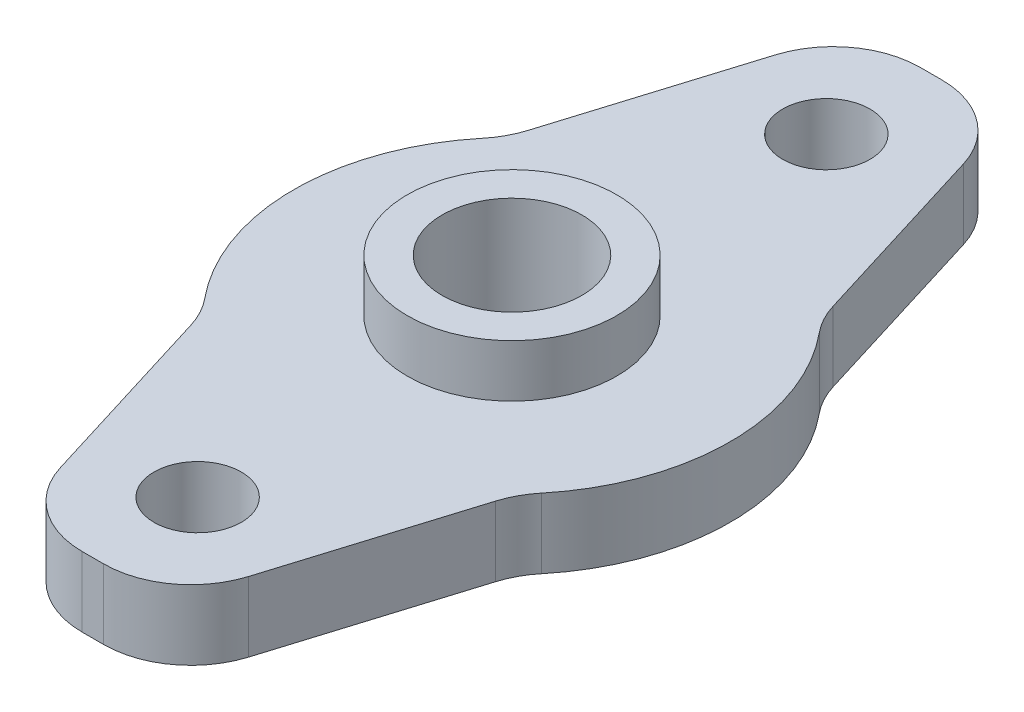
ISO-10303-21;
HEADER;
FILE_DESCRIPTION(('STEP AP214'),'2;1');
FILE_NAME('part.step','',(''),(''),'','','');
FILE_SCHEMA(('AUTOMOTIVE_DESIGN { 1 0 10303 214 1 1 1 1 }'));
ENDSEC;
DATA;
#1=APPLICATION_CONTEXT('core data for automotive mechanical design processes');
#2=APPLICATION_PROTOCOL_DEFINITION('international standard','automotive_design',2000,#1);
#3=PRODUCT_CONTEXT('',#1,'mechanical');
#4=PRODUCT('Part','Part','',(#3));
#5=PRODUCT_RELATED_PRODUCT_CATEGORY('part','',(#4));
#6=PRODUCT_DEFINITION_FORMATION('','',#4);
#7=PRODUCT_DEFINITION_CONTEXT('part definition',#1,'design');
#8=PRODUCT_DEFINITION('design','',#6,#7);
#9=PRODUCT_DEFINITION_SHAPE('','',#8);
#10=(LENGTH_UNIT() NAMED_UNIT(*) SI_UNIT(.MILLI.,.METRE.));
#11=(NAMED_UNIT(*) PLANE_ANGLE_UNIT() SI_UNIT($,.RADIAN.));
#12=(NAMED_UNIT(*) SI_UNIT($,.STERADIAN.) SOLID_ANGLE_UNIT());
#13=UNCERTAINTY_MEASURE_WITH_UNIT(LENGTH_MEASURE(1.E-05),#10,'distance_accuracy_value','');
#14=(GEOMETRIC_REPRESENTATION_CONTEXT(3) GLOBAL_UNCERTAINTY_ASSIGNED_CONTEXT((#13)) GLOBAL_UNIT_ASSIGNED_CONTEXT((#10,
#11,#12)) REPRESENTATION_CONTEXT('',''));
#15=CARTESIAN_POINT('',(0.,0.,0.));
#16=DIRECTION('',(0.,0.,1.));
#17=DIRECTION('',(1.,0.,0.));
#18=AXIS2_PLACEMENT_3D('',#15,#16,#17);
#19=CARTESIAN_POINT('',(0.,4.,0.));
#20=DIRECTION('',(0.,1.,0.));
#21=DIRECTION('',(0.,0.,1.));
#22=AXIS2_PLACEMENT_3D('',#19,#20,#21);
#23=PLANE('',#22);
#24=CARTESIAN_POINT('',(0.,4.,-18.));
#25=DIRECTION('',(0.,1.,0.));
#26=DIRECTION('',(0.,0.,1.));
#27=AXIS2_PLACEMENT_3D('',#24,#25,#26);
#28=CIRCLE('',#27,2.5);
#29=CARTESIAN_POINT('',(0.,4.,-15.5));
#30=VERTEX_POINT('',#29);
#31=EDGE_CURVE('E205',#30,#30,#28,.T.);
#32=ORIENTED_EDGE('',*,*,#31,.F.);
#33=EDGE_LOOP('',(#32));
#34=FACE_BOUND('',#33,.T.);
#35=CARTESIAN_POINT('',(0.,4.,18.));
#36=DIRECTION('',(0.,1.,0.));
#37=DIRECTION('',(0.,0.,1.));
#38=AXIS2_PLACEMENT_3D('',#35,#36,#37);
#39=CIRCLE('',#38,2.5);
#40=CARTESIAN_POINT('',(0.,4.,20.5));
#41=VERTEX_POINT('',#40);
#42=EDGE_CURVE('E208',#41,#41,#39,.F.);
#43=ORIENTED_EDGE('',*,*,#42,.T.);
#44=EDGE_LOOP('',(#43));
#45=FACE_BOUND('',#44,.T.);
#46=DIRECTION('',(-0.294499880692092,0.,-0.955651516125174));
#47=VECTOR('',#46,1.);
#48=CARTESIAN_POINT('',(-10.6870562396262,4.,3.29339380978635));
#49=LINE('',#48,#47);
#50=CARTESIAN_POINT('',(-5.39302963854122,4.,20.4724994034605));
#51=VERTEX_POINT('',#50);
#52=CARTESIAN_POINT('',(-8.72558245149579,4.,9.65837227789803));
#53=VERTEX_POINT('',#52);
#54=EDGE_CURVE('E214',#51,#53,#49,.T.);
#55=ORIENTED_EDGE('',*,*,#54,.F.);
#56=CARTESIAN_POINT('',(-0.614772057915349,4.,19.));
#57=DIRECTION('',(0.,1.,0.));
#58=DIRECTION('',(0.,0.,1.));
#59=AXIS2_PLACEMENT_3D('',#56,#57,#58);
#60=CIRCLE('',#59,5.);
#61=CARTESIAN_POINT('',(-0.614772057915349,4.,24.));
#62=VERTEX_POINT('',#61);
#63=EDGE_CURVE('E331',#51,#62,#60,.T.);
#64=ORIENTED_EDGE('',*,*,#63,.T.);
#65=DIRECTION('',(1.,0.,0.));
#66=VECTOR('',#65,1.);
#67=CARTESIAN_POINT('',(0.,4.,24.));
#68=LINE('',#67,#66);
#69=CARTESIAN_POINT('',(0.614772057915356,4.,24.));
#70=VERTEX_POINT('',#69);
#71=EDGE_CURVE('E211',#62,#70,#68,.T.);
#72=ORIENTED_EDGE('',*,*,#71,.T.);
#73=CARTESIAN_POINT('',(0.614772057915356,4.,19.));
#74=DIRECTION('',(0.,1.,0.));
#75=DIRECTION('',(0.,0.,1.));
#76=AXIS2_PLACEMENT_3D('',#73,#74,#75);
#77=CIRCLE('',#76,5.);
#78=CARTESIAN_POINT('',(5.39302963854122,4.,20.4724994034605));
#79=VERTEX_POINT('',#78);
#80=EDGE_CURVE('E329',#70,#79,#77,.T.);
#81=ORIENTED_EDGE('',*,*,#80,.T.);
#82=DIRECTION('',(0.294499880692093,0.,-0.955651516125174));
#83=VECTOR('',#82,1.);
#84=CARTESIAN_POINT('',(10.6870562396262,4.,3.29339380978637));
#85=LINE('',#84,#83);
#86=CARTESIAN_POINT('',(8.72558245149582,4.,9.65837227789799));
#87=VERTEX_POINT('',#86);
#88=EDGE_CURVE('E228',#79,#87,#85,.T.);
#89=ORIENTED_EDGE('',*,*,#88,.T.);
#90=CARTESIAN_POINT('',(13.5038400321217,4.,11.1308716813585));
#91=DIRECTION('',(0.,1.,0.));
#92=DIRECTION('',(0.,0.,1.));
#93=AXIS2_PLACEMENT_3D('',#90,#91,#92);
#94=CIRCLE('',#93,5.);
#95=CARTESIAN_POINT('',(9.64560002294407,4.,7.95062262954175));
#96=VERTEX_POINT('',#95);
#97=EDGE_CURVE('E349',#87,#96,#94,.F.);
#98=ORIENTED_EDGE('',*,*,#97,.T.);
#99=CARTESIAN_POINT('',(0.,4.,0.));
#100=DIRECTION('',(0.,1.,0.));
#101=DIRECTION('',(0.,0.,1.));
#102=AXIS2_PLACEMENT_3D('',#99,#100,#101);
#103=CIRCLE('',#102,12.5);
#104=CARTESIAN_POINT('',(9.64560002294407,4.,-7.95062262954175));
#105=VERTEX_POINT('',#104);
#106=EDGE_CURVE('E225',#96,#105,#103,.T.);
#107=ORIENTED_EDGE('',*,*,#106,.T.);
#108=CARTESIAN_POINT('',(13.5038400321217,4.,-11.1308716813585));
#109=DIRECTION('',(0.,1.,0.));
#110=DIRECTION('',(0.,0.,1.));
#111=AXIS2_PLACEMENT_3D('',#108,#109,#110);
#112=CIRCLE('',#111,5.);
#113=CARTESIAN_POINT('',(8.72558245149582,4.,-9.65837227789799));
#114=VERTEX_POINT('',#113);
#115=EDGE_CURVE('E345',#105,#114,#112,.F.);
#116=ORIENTED_EDGE('',*,*,#115,.T.);
#117=DIRECTION('',(0.294499880692093,0.,0.955651516125174));
#118=VECTOR('',#117,1.);
#119=CARTESIAN_POINT('',(10.6870562396262,4.,-3.29339380978637));
#120=LINE('',#119,#118);
#121=CARTESIAN_POINT('',(5.39302963854122,4.,-20.4724994034605));
#122=VERTEX_POINT('',#121);
#123=EDGE_CURVE('E222',#122,#114,#120,.T.);
#124=ORIENTED_EDGE('',*,*,#123,.F.);
#125=CARTESIAN_POINT('',(0.614772057915356,4.,-19.));
#126=DIRECTION('',(0.,1.,0.));
#127=DIRECTION('',(0.,0.,1.));
#128=AXIS2_PLACEMENT_3D('',#125,#126,#127);
#129=CIRCLE('',#128,5.);
#130=CARTESIAN_POINT('',(0.614772057915356,4.,-24.));
#131=VERTEX_POINT('',#130);
#132=EDGE_CURVE('E51',#122,#131,#129,.T.);
#133=ORIENTED_EDGE('',*,*,#132,.T.);
#134=DIRECTION('',(1.,0.,0.));
#135=VECTOR('',#134,1.);
#136=CARTESIAN_POINT('',(0.,4.,-24.));
#137=LINE('',#136,#135);
#138=CARTESIAN_POINT('',(-0.614772057915353,4.,-24.));
#139=VERTEX_POINT('',#138);
#140=EDGE_CURVE('E220',#139,#131,#137,.T.);
#141=ORIENTED_EDGE('',*,*,#140,.F.);
#142=CARTESIAN_POINT('',(-0.614772057915353,4.,-19.));
#143=DIRECTION('',(0.,1.,0.));
#144=DIRECTION('',(0.,0.,1.));
#145=AXIS2_PLACEMENT_3D('',#142,#143,#144);
#146=CIRCLE('',#145,5.);
#147=CARTESIAN_POINT('',(-5.39302963854122,4.,-20.4724994034605));
#148=VERTEX_POINT('',#147);
#149=EDGE_CURVE('E326',#139,#148,#146,.T.);
#150=ORIENTED_EDGE('',*,*,#149,.T.);
#151=DIRECTION('',(-0.294499880692092,0.,0.955651516125174));
#152=VECTOR('',#151,1.);
#153=CARTESIAN_POINT('',(-10.6870562396262,4.,-3.29339380978636));
#154=LINE('',#153,#152);
#155=CARTESIAN_POINT('',(-8.7255824514958,4.,-9.65837227789802));
#156=VERTEX_POINT('',#155);
#157=EDGE_CURVE('E217',#148,#156,#154,.T.);
#158=ORIENTED_EDGE('',*,*,#157,.T.);
#159=CARTESIAN_POINT('',(-13.5038400321217,4.,-11.1308716813585));
#160=DIRECTION('',(0.,1.,0.));
#161=DIRECTION('',(0.,0.,1.));
#162=AXIS2_PLACEMENT_3D('',#159,#160,#161);
#163=CIRCLE('',#162,5.);
#164=CARTESIAN_POINT('',(-9.64560002294405,4.,-7.95062262954177));
#165=VERTEX_POINT('',#164);
#166=EDGE_CURVE('E160',#156,#165,#163,.F.);
#167=ORIENTED_EDGE('',*,*,#166,.T.);
#168=CARTESIAN_POINT('',(-9.64560002294405,4.,7.95062262954178));
#169=VERTEX_POINT('',#168);
#170=EDGE_CURVE('E169',#165,#169,#103,.T.);
#171=ORIENTED_EDGE('',*,*,#170,.T.);
#172=CARTESIAN_POINT('',(-13.5038400321217,4.,11.1308716813585));
#173=DIRECTION('',(0.,1.,0.));
#174=DIRECTION('',(0.,0.,1.));
#175=AXIS2_PLACEMENT_3D('',#172,#173,#174);
#176=CIRCLE('',#175,5.);
#177=EDGE_CURVE('E11',#169,#53,#176,.F.);
#178=ORIENTED_EDGE('',*,*,#177,.T.);
#179=EDGE_LOOP('',(#55,#64,#72,#81,#89,#98,#107,#116,#124,#133,#141,#150,#158,#167,#171,#178));
#180=FACE_BOUND('',#179,.T.);
#181=CARTESIAN_POINT('',(0.,4.,0.));
#182=DIRECTION('',(0.,1.,0.));
#183=DIRECTION('',(0.,0.,1.));
#184=AXIS2_PLACEMENT_3D('',#181,#182,#183);
#185=CIRCLE('',#184,6.);
#186=CARTESIAN_POINT('',(0.,4.,6.));
#187=VERTEX_POINT('',#186);
#188=EDGE_CURVE('E202',#187,#187,#185,.T.);
#189=ORIENTED_EDGE('',*,*,#188,.F.);
#190=EDGE_LOOP('',(#189));
#191=FACE_BOUND('',#190,.T.);
#192=ADVANCED_FACE('F36',(#34,#45,#180,#191),#23,.T.);
#193=CARTESIAN_POINT('',(10.6870562396262,4.,3.29339380978637));
#194=DIRECTION('',(-0.955651516125174,0.,-0.294499880692093));
#195=DIRECTION('',(-0.294499880692093,0.,0.955651516125174));
#196=AXIS2_PLACEMENT_3D('',#193,#194,#195);
#197=PLANE('',#196);
#198=DIRECTION('',(0.294499880692093,0.,-0.955651516125174));
#199=VECTOR('',#198,1.);
#200=CARTESIAN_POINT('',(10.6870562396262,0.,3.29339380978637));
#201=LINE('',#200,#199);
#202=CARTESIAN_POINT('',(5.39302963854122,0.,20.4724994034605));
#203=VERTEX_POINT('',#202);
#204=CARTESIAN_POINT('',(8.72558245149582,0.,9.65837227789799));
#205=VERTEX_POINT('',#204);
#206=EDGE_CURVE('E189',#203,#205,#201,.T.);
#207=ORIENTED_EDGE('',*,*,#206,.T.);
#208=DIRECTION('',(0.,1.,0.));
#209=VECTOR('',#208,1.);
#210=CARTESIAN_POINT('',(8.72558245149582,4.,9.65837227789799));
#211=LINE('',#210,#209);
#212=EDGE_CURVE('E369',#205,#87,#211,.T.);
#213=ORIENTED_EDGE('',*,*,#212,.T.);
#214=ORIENTED_EDGE('',*,*,#88,.F.);
#215=DIRECTION('',(0.,-1.,0.));
#216=VECTOR('',#215,1.);
#217=CARTESIAN_POINT('',(5.39302963854122,4.,20.4724994034605));
#218=LINE('',#217,#216);
#219=EDGE_CURVE('E361',#79,#203,#218,.T.);
#220=ORIENTED_EDGE('',*,*,#219,.T.);
#221=EDGE_LOOP('',(#207,#213,#214,#220));
#222=FACE_BOUND('',#221,.T.);
#223=ADVANCED_FACE('F254',(#222),#197,.F.);
#224=CARTESIAN_POINT('',(0.,4.,0.));
#225=DIRECTION('',(0.,-1.,0.));
#226=DIRECTION('',(0.,0.,-1.));
#227=AXIS2_PLACEMENT_3D('',#224,#225,#226);
#228=CYLINDRICAL_SURFACE('',#227,12.5);
#229=CARTESIAN_POINT('',(0.,0.,0.));
#230=DIRECTION('',(0.,1.,0.));
#231=DIRECTION('',(0.,0.,1.));
#232=AXIS2_PLACEMENT_3D('',#229,#230,#231);
#233=CIRCLE('',#232,12.5);
#234=CARTESIAN_POINT('',(9.64560002294407,0.,7.95062262954175));
#235=VERTEX_POINT('',#234);
#236=CARTESIAN_POINT('',(9.64560002294407,0.,-7.95062262954175));
#237=VERTEX_POINT('',#236);
#238=EDGE_CURVE('E180',#235,#237,#233,.T.);
#239=ORIENTED_EDGE('',*,*,#238,.T.);
#240=DIRECTION('',(0.,-1.,0.));
#241=VECTOR('',#240,1.);
#242=CARTESIAN_POINT('',(9.64560002294407,4.,-7.95062262954175));
#243=LINE('',#242,#241);
#244=EDGE_CURVE('E358',#237,#105,#243,.F.);
#245=ORIENTED_EDGE('',*,*,#244,.T.);
#246=ORIENTED_EDGE('',*,*,#106,.F.);
#247=DIRECTION('',(0.,-1.,0.));
#248=VECTOR('',#247,1.);
#249=CARTESIAN_POINT('',(9.64560002294407,4.,7.95062262954175));
#250=LINE('',#249,#248);
#251=EDGE_CURVE('E357',#96,#235,#250,.T.);
#252=ORIENTED_EDGE('',*,*,#251,.T.);
#253=EDGE_LOOP('',(#239,#245,#246,#252));
#254=FACE_BOUND('',#253,.T.);
#255=ADVANCED_FACE('F260',(#254),#228,.T.);
#256=CARTESIAN_POINT('',(10.6870562396262,4.,-3.29339380978637));
#257=DIRECTION('',(0.955651516125174,0.,-0.294499880692093));
#258=DIRECTION('',(-0.294499880692093,0.,-0.955651516125174));
#259=AXIS2_PLACEMENT_3D('',#256,#257,#258);
#260=PLANE('',#259);
#261=ORIENTED_EDGE('',*,*,#123,.T.);
#262=DIRECTION('',(0.,-1.,0.));
#263=VECTOR('',#262,1.);
#264=CARTESIAN_POINT('',(8.72558245149582,4.,-9.65837227789799));
#265=LINE('',#264,#263);
#266=CARTESIAN_POINT('',(8.72558245149582,0.,-9.65837227789799));
#267=VERTEX_POINT('',#266);
#268=EDGE_CURVE('E359',#114,#267,#265,.T.);
#269=ORIENTED_EDGE('',*,*,#268,.T.);
#270=DIRECTION('',(0.294499880692093,0.,0.955651516125174));
#271=VECTOR('',#270,1.);
#272=CARTESIAN_POINT('',(10.6870562396262,0.,-3.29339380978637));
#273=LINE('',#272,#271);
#274=CARTESIAN_POINT('',(5.39302963854122,0.,-20.4724994034605));
#275=VERTEX_POINT('',#274);
#276=EDGE_CURVE('E188',#275,#267,#273,.T.);
#277=ORIENTED_EDGE('',*,*,#276,.F.);
#278=DIRECTION('',(0.,-1.,0.));
#279=VECTOR('',#278,1.);
#280=CARTESIAN_POINT('',(5.39302963854122,4.,-20.4724994034605));
#281=LINE('',#280,#279);
#282=EDGE_CURVE('E364',#275,#122,#281,.F.);
#283=ORIENTED_EDGE('',*,*,#282,.T.);
#284=EDGE_LOOP('',(#261,#269,#277,#283));
#285=FACE_BOUND('',#284,.T.);
#286=ADVANCED_FACE('F295',(#285),#260,.T.);
#287=CARTESIAN_POINT('',(0.,4.,-24.));
#288=DIRECTION('',(0.,0.,-1.));
#289=DIRECTION('',(-1.,0.,0.));
#290=AXIS2_PLACEMENT_3D('',#287,#288,#289);
#291=PLANE('',#290);
#292=DIRECTION('',(1.,0.,0.));
#293=VECTOR('',#292,1.);
#294=CARTESIAN_POINT('',(0.,0.,-24.));
#295=LINE('',#294,#293);
#296=CARTESIAN_POINT('',(-0.614772057915353,0.,-24.));
#297=VERTEX_POINT('',#296);
#298=CARTESIAN_POINT('',(0.614772057915356,0.,-24.));
#299=VERTEX_POINT('',#298);
#300=EDGE_CURVE('E183',#297,#299,#295,.T.);
#301=ORIENTED_EDGE('',*,*,#300,.F.);
#302=DIRECTION('',(0.,-1.,0.));
#303=VECTOR('',#302,1.);
#304=CARTESIAN_POINT('',(-0.614772057915353,4.,-24.));
#305=LINE('',#304,#303);
#306=EDGE_CURVE('E58',#297,#139,#305,.F.);
#307=ORIENTED_EDGE('',*,*,#306,.T.);
#308=ORIENTED_EDGE('',*,*,#140,.T.);
#309=DIRECTION('',(0.,-1.,0.));
#310=VECTOR('',#309,1.);
#311=CARTESIAN_POINT('',(0.614772057915356,4.,-24.));
#312=LINE('',#311,#310);
#313=EDGE_CURVE('E338',#131,#299,#312,.T.);
#314=ORIENTED_EDGE('',*,*,#313,.T.);
#315=EDGE_LOOP('',(#301,#307,#308,#314));
#316=FACE_BOUND('',#315,.T.);
#317=ADVANCED_FACE('F291',(#316),#291,.T.);
#318=CARTESIAN_POINT('',(-10.6870562396262,4.,-3.29339380978636));
#319=DIRECTION('',(0.955651516125174,0.,0.294499880692092));
#320=DIRECTION('',(0.294499880692092,0.,-0.955651516125174));
#321=AXIS2_PLACEMENT_3D('',#318,#319,#320);
#322=PLANE('',#321);
#323=DIRECTION('',(-0.294499880692092,0.,0.955651516125174));
#324=VECTOR('',#323,1.);
#325=CARTESIAN_POINT('',(-10.6870562396262,0.,-3.29339380978636));
#326=LINE('',#325,#324);
#327=CARTESIAN_POINT('',(-5.39302963854122,0.,-20.4724994034605));
#328=VERTEX_POINT('',#327);
#329=CARTESIAN_POINT('',(-8.7255824514958,0.,-9.65837227789802));
#330=VERTEX_POINT('',#329);
#331=EDGE_CURVE('E178',#328,#330,#326,.T.);
#332=ORIENTED_EDGE('',*,*,#331,.T.);
#333=DIRECTION('',(0.,1.,0.));
#334=VECTOR('',#333,1.);
#335=CARTESIAN_POINT('',(-8.7255824514958,4.,-9.65837227789802));
#336=LINE('',#335,#334);
#337=EDGE_CURVE('E155',#330,#156,#336,.T.);
#338=ORIENTED_EDGE('',*,*,#337,.T.);
#339=ORIENTED_EDGE('',*,*,#157,.F.);
#340=DIRECTION('',(0.,-1.,0.));
#341=VECTOR('',#340,1.);
#342=CARTESIAN_POINT('',(-5.39302963854122,0.,-20.4724994034605));
#343=LINE('',#342,#341);
#344=EDGE_CURVE('E170',#148,#328,#343,.T.);
#345=ORIENTED_EDGE('',*,*,#344,.T.);
#346=EDGE_LOOP('',(#332,#338,#339,#345));
#347=FACE_BOUND('',#346,.T.);
#348=ADVANCED_FACE('F288',(#347),#322,.F.);
#349=ORIENTED_EDGE('',*,*,#170,.F.);
#350=DIRECTION('',(0.,-1.,0.));
#351=VECTOR('',#350,1.);
#352=CARTESIAN_POINT('',(-9.64560002294405,4.,-7.95062262954177));
#353=LINE('',#352,#351);
#354=CARTESIAN_POINT('',(-9.64560002294405,0.,-7.95062262954177));
#355=VERTEX_POINT('',#354);
#356=EDGE_CURVE('E154',#165,#355,#353,.T.);
#357=ORIENTED_EDGE('',*,*,#356,.T.);
#358=CARTESIAN_POINT('',(-9.64560002294405,0.,7.95062262954178));
#359=VERTEX_POINT('',#358);
#360=EDGE_CURVE('E166',#355,#359,#233,.T.);
#361=ORIENTED_EDGE('',*,*,#360,.T.);
#362=DIRECTION('',(0.,-1.,0.));
#363=VECTOR('',#362,1.);
#364=CARTESIAN_POINT('',(-9.64560002294405,4.,7.95062262954178));
#365=LINE('',#364,#363);
#366=EDGE_CURVE('E171',#359,#169,#365,.F.);
#367=ORIENTED_EDGE('',*,*,#366,.T.);
#368=EDGE_LOOP('',(#349,#357,#361,#367));
#369=FACE_BOUND('',#368,.T.);
#370=ADVANCED_FACE('F165',(#369),#228,.T.);
#371=CARTESIAN_POINT('',(-10.6870562396262,4.,3.29339380978635));
#372=DIRECTION('',(-0.955651516125174,0.,0.294499880692092));
#373=DIRECTION('',(0.294499880692092,0.,0.955651516125174));
#374=AXIS2_PLACEMENT_3D('',#371,#372,#373);
#375=PLANE('',#374);
#376=ORIENTED_EDGE('',*,*,#54,.T.);
#377=DIRECTION('',(0.,-1.,0.));
#378=VECTOR('',#377,1.);
#379=CARTESIAN_POINT('',(-8.72558245149579,4.,9.65837227789803));
#380=LINE('',#379,#378);
#381=CARTESIAN_POINT('',(-8.72558245149579,0.,9.65837227789803));
#382=VERTEX_POINT('',#381);
#383=EDGE_CURVE('E373',#53,#382,#380,.T.);
#384=ORIENTED_EDGE('',*,*,#383,.T.);
#385=DIRECTION('',(-0.294499880692092,0.,-0.955651516125174));
#386=VECTOR('',#385,1.);
#387=CARTESIAN_POINT('',(-10.6870562396262,0.,3.29339380978635));
#388=LINE('',#387,#386);
#389=CARTESIAN_POINT('',(-5.39302963854122,0.,20.4724994034605));
#390=VERTEX_POINT('',#389);
#391=EDGE_CURVE('E177',#390,#382,#388,.T.);
#392=ORIENTED_EDGE('',*,*,#391,.F.);
#393=DIRECTION('',(0.,-1.,0.));
#394=VECTOR('',#393,1.);
#395=CARTESIAN_POINT('',(-5.39302963854122,4.,20.4724994034605));
#396=LINE('',#395,#394);
#397=EDGE_CURVE('E371',#390,#51,#396,.F.);
#398=ORIENTED_EDGE('',*,*,#397,.T.);
#399=EDGE_LOOP('',(#376,#384,#392,#398));
#400=FACE_BOUND('',#399,.T.);
#401=ADVANCED_FACE('F275',(#400),#375,.T.);
#402=CARTESIAN_POINT('',(0.,4.,0.));
#403=DIRECTION('',(0.,-1.,0.));
#404=DIRECTION('',(0.,0.,-1.));
#405=AXIS2_PLACEMENT_3D('',#402,#403,#404);
#406=CYLINDRICAL_SURFACE('',#405,4.);
#407=CARTESIAN_POINT('',(0.,0.,0.));
#408=DIRECTION('',(0.,1.,0.));
#409=DIRECTION('',(0.,0.,1.));
#410=AXIS2_PLACEMENT_3D('',#407,#408,#409);
#411=CIRCLE('',#410,4.);
#412=CARTESIAN_POINT('',(0.,0.,4.));
#413=VERTEX_POINT('',#412);
#414=EDGE_CURVE('E407',#413,#413,#411,.T.);
#415=ORIENTED_EDGE('',*,*,#414,.F.);
#416=EDGE_LOOP('',(#415));
#417=FACE_BOUND('',#416,.T.);
#418=CARTESIAN_POINT('',(0.,7.,0.));
#419=DIRECTION('',(0.,1.,0.));
#420=DIRECTION('',(0.,0.,1.));
#421=AXIS2_PLACEMENT_3D('',#418,#419,#420);
#422=CIRCLE('',#421,4.);
#423=CARTESIAN_POINT('',(0.,7.,4.));
#424=VERTEX_POINT('',#423);
#425=EDGE_CURVE('E233',#424,#424,#422,.T.);
#426=ORIENTED_EDGE('',*,*,#425,.T.);
#427=EDGE_LOOP('',(#426));
#428=FACE_BOUND('',#427,.T.);
#429=ADVANCED_FACE('F238',(#417,#428),#406,.F.);
#430=CARTESIAN_POINT('',(0.,4.,18.));
#431=DIRECTION('',(0.,-1.,0.));
#432=DIRECTION('',(0.,0.,-1.));
#433=AXIS2_PLACEMENT_3D('',#430,#431,#432);
#434=CYLINDRICAL_SURFACE('',#433,2.5);
#435=ORIENTED_EDGE('',*,*,#42,.F.);
#436=EDGE_LOOP('',(#435));
#437=FACE_BOUND('',#436,.T.);
#438=CARTESIAN_POINT('',(0.,0.,18.));
#439=DIRECTION('',(0.,1.,0.));
#440=DIRECTION('',(0.,0.,1.));
#441=AXIS2_PLACEMENT_3D('',#438,#439,#440);
#442=CIRCLE('',#441,2.5);
#443=CARTESIAN_POINT('',(0.,0.,20.5));
#444=VERTEX_POINT('',#443);
#445=EDGE_CURVE('E404',#444,#444,#442,.F.);
#446=ORIENTED_EDGE('',*,*,#445,.T.);
#447=EDGE_LOOP('',(#446));
#448=FACE_BOUND('',#447,.T.);
#449=ADVANCED_FACE('F274',(#437,#448),#434,.F.);
#450=CARTESIAN_POINT('',(0.,4.,24.));
#451=DIRECTION('',(0.,0.,-1.));
#452=DIRECTION('',(-1.,0.,0.));
#453=AXIS2_PLACEMENT_3D('',#450,#451,#452);
#454=PLANE('',#453);
#455=ORIENTED_EDGE('',*,*,#71,.F.);
#456=DIRECTION('',(0.,-1.,0.));
#457=VECTOR('',#456,1.);
#458=CARTESIAN_POINT('',(-0.614772057915349,0.,24.));
#459=LINE('',#458,#457);
#460=CARTESIAN_POINT('',(-0.614772057915349,0.,24.));
#461=VERTEX_POINT('',#460);
#462=EDGE_CURVE('E378',#62,#461,#459,.T.);
#463=ORIENTED_EDGE('',*,*,#462,.T.);
#464=DIRECTION('',(1.,0.,0.));
#465=VECTOR('',#464,1.);
#466=CARTESIAN_POINT('',(0.,0.,24.));
#467=LINE('',#466,#465);
#468=CARTESIAN_POINT('',(0.614772057915356,0.,24.));
#469=VERTEX_POINT('',#468);
#470=EDGE_CURVE('E181',#461,#469,#467,.T.);
#471=ORIENTED_EDGE('',*,*,#470,.T.);
#472=DIRECTION('',(0.,-1.,0.));
#473=VECTOR('',#472,1.);
#474=CARTESIAN_POINT('',(0.614772057915356,4.,24.));
#475=LINE('',#474,#473);
#476=EDGE_CURVE('E376',#469,#70,#475,.F.);
#477=ORIENTED_EDGE('',*,*,#476,.T.);
#478=EDGE_LOOP('',(#455,#463,#471,#477));
#479=FACE_BOUND('',#478,.T.);
#480=ADVANCED_FACE('F270',(#479),#454,.F.);
#481=CARTESIAN_POINT('',(0.,4.,-18.));
#482=DIRECTION('',(0.,-1.,0.));
#483=DIRECTION('',(0.,0.,-1.));
#484=AXIS2_PLACEMENT_3D('',#481,#482,#483);
#485=CYLINDRICAL_SURFACE('',#484,2.5);
#486=ORIENTED_EDGE('',*,*,#31,.T.);
#487=EDGE_LOOP('',(#486));
#488=FACE_BOUND('',#487,.T.);
#489=CARTESIAN_POINT('',(0.,0.,-18.));
#490=DIRECTION('',(0.,1.,0.));
#491=DIRECTION('',(0.,0.,1.));
#492=AXIS2_PLACEMENT_3D('',#489,#490,#491);
#493=CIRCLE('',#492,2.5);
#494=CARTESIAN_POINT('',(0.,0.,-15.5));
#495=VERTEX_POINT('',#494);
#496=EDGE_CURVE('E231',#495,#495,#493,.T.);
#497=ORIENTED_EDGE('',*,*,#496,.F.);
#498=EDGE_LOOP('',(#497));
#499=FACE_BOUND('',#498,.T.);
#500=ADVANCED_FACE('F267',(#488,#499),#485,.F.);
#501=CARTESIAN_POINT('',(0.,0.,0.));
#502=DIRECTION('',(0.,1.,0.));
#503=DIRECTION('',(0.,0.,1.));
#504=AXIS2_PLACEMENT_3D('',#501,#502,#503);
#505=PLANE('',#504);
#506=ORIENTED_EDGE('',*,*,#470,.F.);
#507=CARTESIAN_POINT('',(-0.614772057915349,0.,19.));
#508=DIRECTION('',(0.,1.,0.));
#509=DIRECTION('',(0.,0.,1.));
#510=AXIS2_PLACEMENT_3D('',#507,#508,#509);
#511=CIRCLE('',#510,5.);
#512=EDGE_CURVE('E333',#461,#390,#511,.F.);
#513=ORIENTED_EDGE('',*,*,#512,.T.);
#514=ORIENTED_EDGE('',*,*,#391,.T.);
#515=CARTESIAN_POINT('',(-13.5038400321217,0.,11.1308716813585));
#516=DIRECTION('',(0.,1.,0.));
#517=DIRECTION('',(0.,0.,1.));
#518=AXIS2_PLACEMENT_3D('',#515,#516,#517);
#519=CIRCLE('',#518,5.);
#520=EDGE_CURVE('E44',#382,#359,#519,.T.);
#521=ORIENTED_EDGE('',*,*,#520,.T.);
#522=ORIENTED_EDGE('',*,*,#360,.F.);
#523=CARTESIAN_POINT('',(-13.5038400321217,0.,-11.1308716813585));
#524=DIRECTION('',(0.,1.,0.));
#525=DIRECTION('',(0.,0.,1.));
#526=AXIS2_PLACEMENT_3D('',#523,#524,#525);
#527=CIRCLE('',#526,5.);
#528=EDGE_CURVE('E150',#355,#330,#527,.T.);
#529=ORIENTED_EDGE('',*,*,#528,.T.);
#530=ORIENTED_EDGE('',*,*,#331,.F.);
#531=CARTESIAN_POINT('',(-0.614772057915353,0.,-19.));
#532=DIRECTION('',(0.,1.,0.));
#533=DIRECTION('',(0.,0.,1.));
#534=AXIS2_PLACEMENT_3D('',#531,#532,#533);
#535=CIRCLE('',#534,5.);
#536=EDGE_CURVE('E383',#328,#297,#535,.F.);
#537=ORIENTED_EDGE('',*,*,#536,.T.);
#538=ORIENTED_EDGE('',*,*,#300,.T.);
#539=CARTESIAN_POINT('',(0.614772057915356,0.,-19.));
#540=DIRECTION('',(0.,1.,0.));
#541=DIRECTION('',(0.,0.,1.));
#542=AXIS2_PLACEMENT_3D('',#539,#540,#541);
#543=CIRCLE('',#542,5.);
#544=EDGE_CURVE('E381',#299,#275,#543,.F.);
#545=ORIENTED_EDGE('',*,*,#544,.T.);
#546=ORIENTED_EDGE('',*,*,#276,.T.);
#547=CARTESIAN_POINT('',(13.5038400321217,0.,-11.1308716813585));
#548=DIRECTION('',(0.,1.,0.));
#549=DIRECTION('',(0.,0.,1.));
#550=AXIS2_PLACEMENT_3D('',#547,#548,#549);
#551=CIRCLE('',#550,5.);
#552=EDGE_CURVE('E343',#267,#237,#551,.T.);
#553=ORIENTED_EDGE('',*,*,#552,.T.);
#554=ORIENTED_EDGE('',*,*,#238,.F.);
#555=CARTESIAN_POINT('',(13.5038400321217,0.,11.1308716813585));
#556=DIRECTION('',(0.,1.,0.));
#557=DIRECTION('',(0.,0.,1.));
#558=AXIS2_PLACEMENT_3D('',#555,#556,#557);
#559=CIRCLE('',#558,5.);
#560=EDGE_CURVE('E347',#235,#205,#559,.T.);
#561=ORIENTED_EDGE('',*,*,#560,.T.);
#562=ORIENTED_EDGE('',*,*,#206,.F.);
#563=CARTESIAN_POINT('',(0.614772057915356,0.,19.));
#564=DIRECTION('',(0.,1.,0.));
#565=DIRECTION('',(0.,0.,1.));
#566=AXIS2_PLACEMENT_3D('',#563,#564,#565);
#567=CIRCLE('',#566,5.);
#568=EDGE_CURVE('E385',#203,#469,#567,.F.);
#569=ORIENTED_EDGE('',*,*,#568,.T.);
#570=EDGE_LOOP('',(#506,#513,#514,#521,#522,#529,#530,#537,#538,#545,#546,#553,#554,#561,#562,#569));
#571=FACE_BOUND('',#570,.T.);
#572=ORIENTED_EDGE('',*,*,#445,.F.);
#573=EDGE_LOOP('',(#572));
#574=FACE_BOUND('',#573,.T.);
#575=ORIENTED_EDGE('',*,*,#414,.T.);
#576=EDGE_LOOP('',(#575));
#577=FACE_BOUND('',#576,.T.);
#578=ORIENTED_EDGE('',*,*,#496,.T.);
#579=EDGE_LOOP('',(#578));
#580=FACE_BOUND('',#579,.T.);
#581=ADVANCED_FACE('F174',(#571,#574,#577,#580),#505,.F.);
#582=CARTESIAN_POINT('',(-13.5038400321217,4.,-11.1308716813585));
#583=DIRECTION('',(0.,-1.,0.));
#584=DIRECTION('',(0.,0.,-1.));
#585=AXIS2_PLACEMENT_3D('',#582,#583,#584);
#586=CYLINDRICAL_SURFACE('',#585,5.);
#587=ORIENTED_EDGE('',*,*,#166,.F.);
#588=ORIENTED_EDGE('',*,*,#337,.F.);
#589=ORIENTED_EDGE('',*,*,#528,.F.);
#590=ORIENTED_EDGE('',*,*,#356,.F.);
#591=EDGE_LOOP('',(#587,#588,#589,#590));
#592=FACE_BOUND('',#591,.T.);
#593=ADVANCED_FACE('F153',(#592),#586,.F.);
#594=CARTESIAN_POINT('',(13.5038400321217,4.,-11.1308716813585));
#595=DIRECTION('',(0.,-1.,0.));
#596=DIRECTION('',(0.,0.,-1.));
#597=AXIS2_PLACEMENT_3D('',#594,#595,#596);
#598=CYLINDRICAL_SURFACE('',#597,5.);
#599=ORIENTED_EDGE('',*,*,#115,.F.);
#600=ORIENTED_EDGE('',*,*,#244,.F.);
#601=ORIENTED_EDGE('',*,*,#552,.F.);
#602=ORIENTED_EDGE('',*,*,#268,.F.);
#603=EDGE_LOOP('',(#599,#600,#601,#602));
#604=FACE_BOUND('',#603,.T.);
#605=ADVANCED_FACE('F301',(#604),#598,.F.);
#606=CARTESIAN_POINT('',(13.5038400321217,4.,11.1308716813585));
#607=DIRECTION('',(0.,-1.,0.));
#608=DIRECTION('',(0.,0.,-1.));
#609=AXIS2_PLACEMENT_3D('',#606,#607,#608);
#610=CYLINDRICAL_SURFACE('',#609,5.);
#611=ORIENTED_EDGE('',*,*,#97,.F.);
#612=ORIENTED_EDGE('',*,*,#212,.F.);
#613=ORIENTED_EDGE('',*,*,#560,.F.);
#614=ORIENTED_EDGE('',*,*,#251,.F.);
#615=EDGE_LOOP('',(#611,#612,#613,#614));
#616=FACE_BOUND('',#615,.T.);
#617=ADVANCED_FACE('F304',(#616),#610,.F.);
#618=CARTESIAN_POINT('',(-13.5038400321217,4.,11.1308716813585));
#619=DIRECTION('',(0.,-1.,0.));
#620=DIRECTION('',(0.,0.,-1.));
#621=AXIS2_PLACEMENT_3D('',#618,#619,#620);
#622=CYLINDRICAL_SURFACE('',#621,5.);
#623=ORIENTED_EDGE('',*,*,#177,.F.);
#624=ORIENTED_EDGE('',*,*,#366,.F.);
#625=ORIENTED_EDGE('',*,*,#520,.F.);
#626=ORIENTED_EDGE('',*,*,#383,.F.);
#627=EDGE_LOOP('',(#623,#624,#625,#626));
#628=FACE_BOUND('',#627,.T.);
#629=ADVANCED_FACE('F308',(#628),#622,.F.);
#630=CARTESIAN_POINT('',(-0.614772057915349,4.,19.));
#631=DIRECTION('',(0.,1.,0.));
#632=DIRECTION('',(0.,0.,1.));
#633=AXIS2_PLACEMENT_3D('',#630,#631,#632);
#634=CYLINDRICAL_SURFACE('',#633,5.);
#635=ORIENTED_EDGE('',*,*,#63,.F.);
#636=ORIENTED_EDGE('',*,*,#397,.F.);
#637=ORIENTED_EDGE('',*,*,#512,.F.);
#638=ORIENTED_EDGE('',*,*,#462,.F.);
#639=EDGE_LOOP('',(#635,#636,#637,#638));
#640=FACE_BOUND('',#639,.T.);
#641=ADVANCED_FACE('F312',(#640),#634,.T.);
#642=CARTESIAN_POINT('',(0.614772057915356,4.,19.));
#643=DIRECTION('',(0.,-1.,0.));
#644=DIRECTION('',(0.,0.,-1.));
#645=AXIS2_PLACEMENT_3D('',#642,#643,#644);
#646=CYLINDRICAL_SURFACE('',#645,5.);
#647=ORIENTED_EDGE('',*,*,#80,.F.);
#648=ORIENTED_EDGE('',*,*,#476,.F.);
#649=ORIENTED_EDGE('',*,*,#568,.F.);
#650=ORIENTED_EDGE('',*,*,#219,.F.);
#651=EDGE_LOOP('',(#647,#648,#649,#650));
#652=FACE_BOUND('',#651,.T.);
#653=ADVANCED_FACE('F316',(#652),#646,.T.);
#654=CARTESIAN_POINT('',(-0.614772057915353,4.,-19.));
#655=DIRECTION('',(0.,1.,0.));
#656=DIRECTION('',(0.,0.,1.));
#657=AXIS2_PLACEMENT_3D('',#654,#655,#656);
#658=CYLINDRICAL_SURFACE('',#657,5.);
#659=ORIENTED_EDGE('',*,*,#149,.F.);
#660=ORIENTED_EDGE('',*,*,#306,.F.);
#661=ORIENTED_EDGE('',*,*,#536,.F.);
#662=ORIENTED_EDGE('',*,*,#344,.F.);
#663=EDGE_LOOP('',(#659,#660,#661,#662));
#664=FACE_BOUND('',#663,.T.);
#665=ADVANCED_FACE('F251',(#664),#658,.T.);
#666=CARTESIAN_POINT('',(0.614772057915356,4.,-19.));
#667=DIRECTION('',(0.,-1.,0.));
#668=DIRECTION('',(0.,0.,-1.));
#669=AXIS2_PLACEMENT_3D('',#666,#667,#668);
#670=CYLINDRICAL_SURFACE('',#669,5.);
#671=ORIENTED_EDGE('',*,*,#132,.F.);
#672=ORIENTED_EDGE('',*,*,#282,.F.);
#673=ORIENTED_EDGE('',*,*,#544,.F.);
#674=ORIENTED_EDGE('',*,*,#313,.F.);
#675=EDGE_LOOP('',(#671,#672,#673,#674));
#676=FACE_BOUND('',#675,.T.);
#677=ADVANCED_FACE('F38',(#676),#670,.T.);
#678=CARTESIAN_POINT('',(0.,7.,0.));
#679=DIRECTION('',(0.,1.,0.));
#680=DIRECTION('',(0.,0.,1.));
#681=AXIS2_PLACEMENT_3D('',#678,#679,#680);
#682=PLANE('',#681);
#683=CARTESIAN_POINT('',(0.,7.,0.));
#684=DIRECTION('',(0.,1.,0.));
#685=DIRECTION('',(0.,0.,1.));
#686=AXIS2_PLACEMENT_3D('',#683,#684,#685);
#687=CIRCLE('',#686,6.);
#688=CARTESIAN_POINT('',(0.,7.,6.));
#689=VERTEX_POINT('',#688);
#690=EDGE_CURVE('E196',#689,#689,#687,.T.);
#691=ORIENTED_EDGE('',*,*,#690,.T.);
#692=EDGE_LOOP('',(#691));
#693=FACE_BOUND('',#692,.T.);
#694=ORIENTED_EDGE('',*,*,#425,.F.);
#695=EDGE_LOOP('',(#694));
#696=FACE_BOUND('',#695,.T.);
#697=ADVANCED_FACE('F240',(#693,#696),#682,.T.);
#698=CARTESIAN_POINT('',(0.,7.,0.));
#699=DIRECTION('',(0.,-1.,0.));
#700=DIRECTION('',(0.,0.,-1.));
#701=AXIS2_PLACEMENT_3D('',#698,#699,#700);
#702=CYLINDRICAL_SURFACE('',#701,6.);
#703=ORIENTED_EDGE('',*,*,#690,.F.);
#704=EDGE_LOOP('',(#703));
#705=FACE_BOUND('',#704,.T.);
#706=ORIENTED_EDGE('',*,*,#188,.T.);
#707=EDGE_LOOP('',(#706));
#708=FACE_BOUND('',#707,.T.);
#709=ADVANCED_FACE('F242',(#705,#708),#702,.T.);
#710=CLOSED_SHELL('',(#192,#223,#255,#286,#317,#348,#370,#401,#429,#449,#480,#500,#581,#593,
#605,#617,#629,#641,#653,#665,#677,#697,#709));
#711=MANIFOLD_SOLID_BREP('B2',#710);
#712=ADVANCED_BREP_SHAPE_REPRESENTATION('',(#18,#711),#14);
#713=SHAPE_DEFINITION_REPRESENTATION(#9,#712);
ENDSEC;
END-ISO-10303-21;
